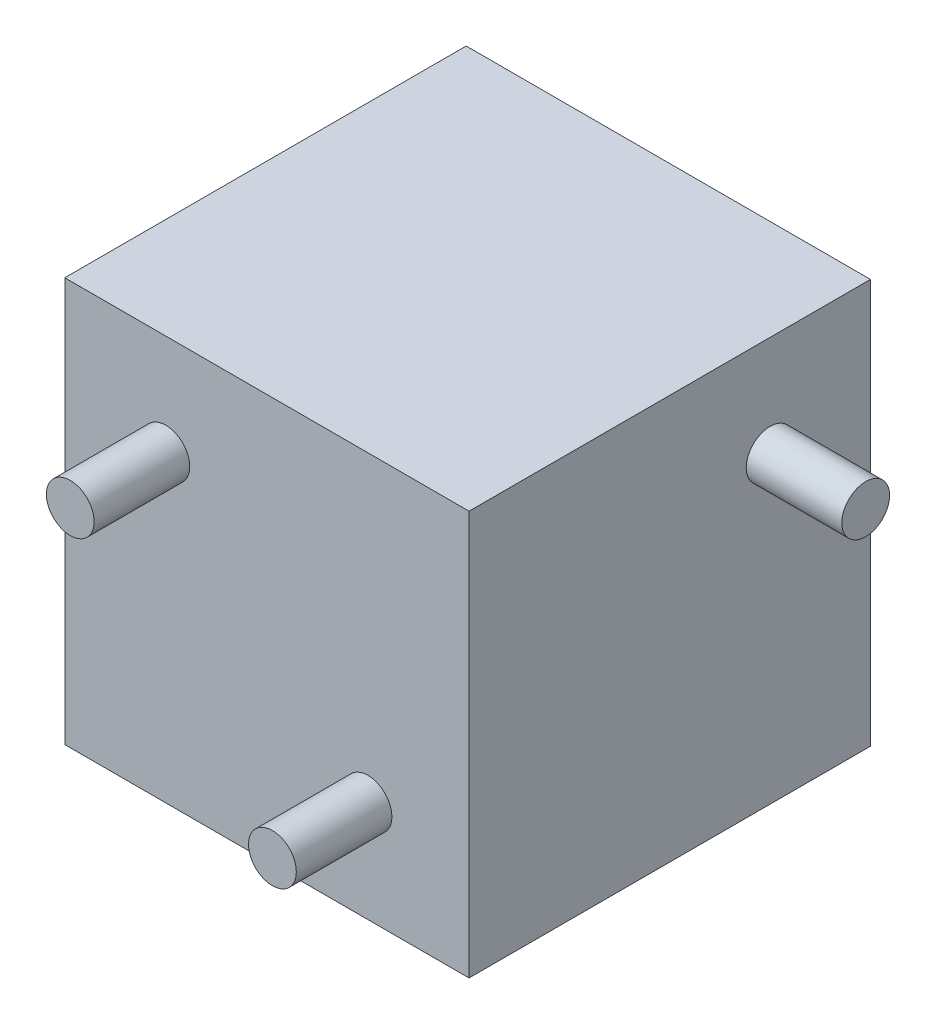
ISO-10303-21;
HEADER;
FILE_DESCRIPTION(('STEP AP214'),'2;1');
FILE_NAME('part.step','',(''),(''),'','','');
FILE_SCHEMA(('AUTOMOTIVE_DESIGN { 1 0 10303 214 1 1 1 1 }'));
ENDSEC;
DATA;
#1=APPLICATION_CONTEXT('core data for automotive mechanical design processes');
#2=APPLICATION_PROTOCOL_DEFINITION('international standard','automotive_design',2000,#1);
#3=PRODUCT_CONTEXT('',#1,'mechanical');
#4=PRODUCT('Part','Part','',(#3));
#5=PRODUCT_RELATED_PRODUCT_CATEGORY('part','',(#4));
#6=PRODUCT_DEFINITION_FORMATION('','',#4);
#7=PRODUCT_DEFINITION_CONTEXT('part definition',#1,'design');
#8=PRODUCT_DEFINITION('design','',#6,#7);
#9=PRODUCT_DEFINITION_SHAPE('','',#8);
#10=(LENGTH_UNIT() NAMED_UNIT(*) SI_UNIT(.MILLI.,.METRE.));
#11=(NAMED_UNIT(*) PLANE_ANGLE_UNIT() SI_UNIT($,.RADIAN.));
#12=(NAMED_UNIT(*) SI_UNIT($,.STERADIAN.) SOLID_ANGLE_UNIT());
#13=UNCERTAINTY_MEASURE_WITH_UNIT(LENGTH_MEASURE(1.E-05),#10,'distance_accuracy_value','');
#14=(GEOMETRIC_REPRESENTATION_CONTEXT(3) GLOBAL_UNCERTAINTY_ASSIGNED_CONTEXT((#13)) GLOBAL_UNIT_ASSIGNED_CONTEXT((#10,
#11,#12)) REPRESENTATION_CONTEXT('',''));
#15=CARTESIAN_POINT('',(0.,0.,0.));
#16=DIRECTION('',(0.,0.,1.));
#17=DIRECTION('',(1.,0.,0.));
#18=AXIS2_PLACEMENT_3D('',#15,#16,#17);
#19=CARTESIAN_POINT('',(-42.3,42.3,-10.));
#20=DIRECTION('',(0.,0.,1.));
#21=DIRECTION('',(1.,0.,0.));
#22=AXIS2_PLACEMENT_3D('',#19,#20,#21);
#23=CYLINDRICAL_SURFACE('',#22,5.);
#24=CARTESIAN_POINT('',(-42.3,42.3,-10.));
#25=DIRECTION('',(0.,0.,1.));
#26=DIRECTION('',(1.,0.,0.));
#27=AXIS2_PLACEMENT_3D('',#24,#25,#26);
#28=CIRCLE('',#27,5.);
#29=CARTESIAN_POINT('',(-37.3,42.3,-10.));
#30=VERTEX_POINT('',#29);
#31=EDGE_CURVE('E113',#30,#30,#28,.T.);
#32=ORIENTED_EDGE('',*,*,#31,.T.);
#33=EDGE_LOOP('',(#32));
#34=FACE_BOUND('',#33,.T.);
#35=CARTESIAN_POINT('',(-42.3,42.3,10.));
#36=DIRECTION('',(0.,0.,1.));
#37=DIRECTION('',(1.,0.,0.));
#38=AXIS2_PLACEMENT_3D('',#35,#36,#37);
#39=CIRCLE('',#38,5.);
#40=CARTESIAN_POINT('',(-37.3,42.3,10.));
#41=VERTEX_POINT('',#40);
#42=EDGE_CURVE('E114',#41,#41,#39,.T.);
#43=ORIENTED_EDGE('',*,*,#42,.F.);
#44=EDGE_LOOP('',(#43));
#45=FACE_BOUND('',#44,.T.);
#46=ADVANCED_FACE('F36',(#34,#45),#23,.T.);
#47=CARTESIAN_POINT('',(0.,0.,10.));
#48=DIRECTION('',(0.,0.,1.));
#49=DIRECTION('',(1.,0.,0.));
#50=AXIS2_PLACEMENT_3D('',#47,#48,#49);
#51=PLANE('',#50);
#52=ORIENTED_EDGE('',*,*,#42,.T.);
#53=EDGE_LOOP('',(#52));
#54=FACE_BOUND('',#53,.T.);
#55=ADVANCED_FACE('F145',(#54),#51,.T.);
#56=CARTESIAN_POINT('',(-63.45,-21.15,-94.));
#57=DIRECTION('',(1.,0.,0.));
#58=DIRECTION('',(0.,0.,-1.));
#59=AXIS2_PLACEMENT_3D('',#56,#57,#58);
#60=PLANE('',#59);
#61=DIRECTION('',(0.,1.,0.));
#62=VECTOR('',#61,1.);
#63=CARTESIAN_POINT('',(-63.45,-21.15,-10.));
#64=LINE('',#63,#62);
#65=CARTESIAN_POINT('',(-63.45,-21.15,-10.));
#66=VERTEX_POINT('',#65);
#67=CARTESIAN_POINT('',(-63.45,63.45,-10.));
#68=VERTEX_POINT('',#67);
#69=EDGE_CURVE('E103',#66,#68,#64,.T.);
#70=ORIENTED_EDGE('',*,*,#69,.T.);
#71=DIRECTION('',(0.,0.,1.));
#72=VECTOR('',#71,1.);
#73=CARTESIAN_POINT('',(-63.45,63.45,-94.));
#74=LINE('',#73,#72);
#75=CARTESIAN_POINT('',(-63.45,63.45,-94.));
#76=VERTEX_POINT('',#75);
#77=EDGE_CURVE('E94',#76,#68,#74,.T.);
#78=ORIENTED_EDGE('',*,*,#77,.F.);
#79=DIRECTION('',(0.,1.,0.));
#80=VECTOR('',#79,1.);
#81=CARTESIAN_POINT('',(-63.45,-21.15,-94.));
#82=LINE('',#81,#80);
#83=CARTESIAN_POINT('',(-63.45,-21.15,-94.));
#84=VERTEX_POINT('',#83);
#85=EDGE_CURVE('E88',#84,#76,#82,.T.);
#86=ORIENTED_EDGE('',*,*,#85,.F.);
#87=DIRECTION('',(0.,0.,1.));
#88=VECTOR('',#87,1.);
#89=CARTESIAN_POINT('',(-63.45,-21.15,-94.));
#90=LINE('',#89,#88);
#91=EDGE_CURVE('E99',#84,#66,#90,.T.);
#92=ORIENTED_EDGE('',*,*,#91,.T.);
#93=EDGE_LOOP('',(#70,#78,#86,#92));
#94=FACE_BOUND('',#93,.T.);
#95=ADVANCED_FACE('F132',(#94),#60,.F.);
#96=CARTESIAN_POINT('',(21.15,63.45,-94.));
#97=DIRECTION('',(0.,-1.,0.));
#98=DIRECTION('',(0.,0.,-1.));
#99=AXIS2_PLACEMENT_3D('',#96,#97,#98);
#100=PLANE('',#99);
#101=DIRECTION('',(1.,0.,0.));
#102=VECTOR('',#101,1.);
#103=CARTESIAN_POINT('',(21.15,63.45,-10.));
#104=LINE('',#103,#102);
#105=CARTESIAN_POINT('',(21.15,63.45,-10.));
#106=VERTEX_POINT('',#105);
#107=EDGE_CURVE('E93',#68,#106,#104,.T.);
#108=ORIENTED_EDGE('',*,*,#107,.T.);
#109=DIRECTION('',(0.,0.,1.));
#110=VECTOR('',#109,1.);
#111=CARTESIAN_POINT('',(21.15,63.45,-94.));
#112=LINE('',#111,#110);
#113=CARTESIAN_POINT('',(21.15,63.45,-94.));
#114=VERTEX_POINT('',#113);
#115=EDGE_CURVE('E91',#114,#106,#112,.T.);
#116=ORIENTED_EDGE('',*,*,#115,.F.);
#117=DIRECTION('',(1.,0.,0.));
#118=VECTOR('',#117,1.);
#119=CARTESIAN_POINT('',(21.15,63.45,-94.));
#120=LINE('',#119,#118);
#121=EDGE_CURVE('E83',#76,#114,#120,.T.);
#122=ORIENTED_EDGE('',*,*,#121,.F.);
#123=ORIENTED_EDGE('',*,*,#77,.T.);
#124=EDGE_LOOP('',(#108,#116,#122,#123));
#125=FACE_BOUND('',#124,.T.);
#126=ADVANCED_FACE('F92',(#125),#100,.F.);
#127=CARTESIAN_POINT('',(21.15,-21.15,-94.));
#128=DIRECTION('',(-1.,0.,0.));
#129=DIRECTION('',(0.,0.,1.));
#130=AXIS2_PLACEMENT_3D('',#127,#128,#129);
#131=PLANE('',#130);
#132=CARTESIAN_POINT('',(21.15,42.3214646234765,-73.0002290170693));
#133=DIRECTION('',(-1.,0.,0.));
#134=DIRECTION('',(0.,0.,1.));
#135=AXIS2_PLACEMENT_3D('',#132,#133,#134);
#136=CIRCLE('',#135,5.00000000000001);
#137=CARTESIAN_POINT('',(21.15,42.3214646234765,-68.0002290170693));
#138=VERTEX_POINT('',#137);
#139=EDGE_CURVE('E11',#138,#138,#136,.F.);
#140=ORIENTED_EDGE('',*,*,#139,.F.);
#141=EDGE_LOOP('',(#140));
#142=FACE_BOUND('',#141,.T.);
#143=DIRECTION('',(0.,-1.,0.));
#144=VECTOR('',#143,1.);
#145=CARTESIAN_POINT('',(21.15,-21.15,-10.));
#146=LINE('',#145,#144);
#147=CARTESIAN_POINT('',(21.15,-21.15,-10.));
#148=VERTEX_POINT('',#147);
#149=EDGE_CURVE('E69',#106,#148,#146,.T.);
#150=ORIENTED_EDGE('',*,*,#149,.T.);
#151=DIRECTION('',(0.,0.,1.));
#152=VECTOR('',#151,1.);
#153=CARTESIAN_POINT('',(21.15,-21.15,-94.));
#154=LINE('',#153,#152);
#155=CARTESIAN_POINT('',(21.15,-21.15,-94.));
#156=VERTEX_POINT('',#155);
#157=EDGE_CURVE('E95',#156,#148,#154,.T.);
#158=ORIENTED_EDGE('',*,*,#157,.F.);
#159=DIRECTION('',(0.,-1.,0.));
#160=VECTOR('',#159,1.);
#161=CARTESIAN_POINT('',(21.15,-21.15,-94.));
#162=LINE('',#161,#160);
#163=EDGE_CURVE('E86',#114,#156,#162,.T.);
#164=ORIENTED_EDGE('',*,*,#163,.F.);
#165=ORIENTED_EDGE('',*,*,#115,.T.);
#166=EDGE_LOOP('',(#150,#158,#164,#165));
#167=FACE_BOUND('',#166,.T.);
#168=ADVANCED_FACE('F97',(#142,#167),#131,.F.);
#169=CARTESIAN_POINT('',(21.15,-21.15,-94.));
#170=DIRECTION('',(0.,1.,0.));
#171=DIRECTION('',(0.,0.,1.));
#172=AXIS2_PLACEMENT_3D('',#169,#170,#171);
#173=PLANE('',#172);
#174=DIRECTION('',(-1.,0.,0.));
#175=VECTOR('',#174,1.);
#176=CARTESIAN_POINT('',(21.15,-21.15,-10.));
#177=LINE('',#176,#175);
#178=EDGE_CURVE('E75',#148,#66,#177,.T.);
#179=ORIENTED_EDGE('',*,*,#178,.T.);
#180=ORIENTED_EDGE('',*,*,#91,.F.);
#181=DIRECTION('',(-1.,0.,0.));
#182=VECTOR('',#181,1.);
#183=CARTESIAN_POINT('',(21.15,-21.15,-94.));
#184=LINE('',#183,#182);
#185=EDGE_CURVE('E52',#156,#84,#184,.T.);
#186=ORIENTED_EDGE('',*,*,#185,.F.);
#187=ORIENTED_EDGE('',*,*,#157,.T.);
#188=EDGE_LOOP('',(#179,#180,#186,#187));
#189=FACE_BOUND('',#188,.T.);
#190=ADVANCED_FACE('F133',(#189),#173,.F.);
#191=CARTESIAN_POINT('',(0.,0.,-94.));
#192=DIRECTION('',(0.,0.,1.));
#193=DIRECTION('',(1.,0.,0.));
#194=AXIS2_PLACEMENT_3D('',#191,#192,#193);
#195=PLANE('',#194);
#196=ORIENTED_EDGE('',*,*,#85,.T.);
#197=ORIENTED_EDGE('',*,*,#121,.T.);
#198=ORIENTED_EDGE('',*,*,#163,.T.);
#199=ORIENTED_EDGE('',*,*,#185,.T.);
#200=EDGE_LOOP('',(#196,#197,#198,#199));
#201=FACE_BOUND('',#200,.T.);
#202=ADVANCED_FACE('F84',(#201),#195,.F.);
#203=CARTESIAN_POINT('',(0.,0.,-10.));
#204=DIRECTION('',(0.,0.,1.));
#205=DIRECTION('',(1.,0.,0.));
#206=AXIS2_PLACEMENT_3D('',#203,#204,#205);
#207=PLANE('',#206);
#208=CARTESIAN_POINT('',(0.,0.,-10.));
#209=DIRECTION('',(0.,0.,1.));
#210=DIRECTION('',(1.,0.,0.));
#211=AXIS2_PLACEMENT_3D('',#208,#209,#210);
#212=CIRCLE('',#211,5.);
#213=CARTESIAN_POINT('',(5.,0.,-10.));
#214=VERTEX_POINT('',#213);
#215=EDGE_CURVE('E44',#214,#214,#212,.T.);
#216=ORIENTED_EDGE('',*,*,#215,.F.);
#217=EDGE_LOOP('',(#216));
#218=FACE_BOUND('',#217,.T.);
#219=ORIENTED_EDGE('',*,*,#31,.F.);
#220=EDGE_LOOP('',(#219));
#221=FACE_BOUND('',#220,.T.);
#222=ORIENTED_EDGE('',*,*,#69,.F.);
#223=ORIENTED_EDGE('',*,*,#178,.F.);
#224=ORIENTED_EDGE('',*,*,#149,.F.);
#225=ORIENTED_EDGE('',*,*,#107,.F.);
#226=EDGE_LOOP('',(#222,#223,#224,#225));
#227=FACE_BOUND('',#226,.T.);
#228=ADVANCED_FACE('F124',(#218,#221,#227),#207,.T.);
#229=CARTESIAN_POINT('',(0.,0.,-10.));
#230=DIRECTION('',(0.,0.,1.));
#231=DIRECTION('',(1.,0.,0.));
#232=AXIS2_PLACEMENT_3D('',#229,#230,#231);
#233=CYLINDRICAL_SURFACE('',#232,5.);
#234=ORIENTED_EDGE('',*,*,#215,.T.);
#235=EDGE_LOOP('',(#234));
#236=FACE_BOUND('',#235,.T.);
#237=CARTESIAN_POINT('',(0.,0.,10.));
#238=DIRECTION('',(0.,0.,1.));
#239=DIRECTION('',(1.,0.,0.));
#240=AXIS2_PLACEMENT_3D('',#237,#238,#239);
#241=CIRCLE('',#240,5.);
#242=CARTESIAN_POINT('',(5.,0.,10.));
#243=VERTEX_POINT('',#242);
#244=EDGE_CURVE('E106',#243,#243,#241,.T.);
#245=ORIENTED_EDGE('',*,*,#244,.F.);
#246=EDGE_LOOP('',(#245));
#247=FACE_BOUND('',#246,.T.);
#248=ADVANCED_FACE('F121',(#236,#247),#233,.T.);
#249=CARTESIAN_POINT('',(0.,0.,10.));
#250=DIRECTION('',(0.,0.,1.));
#251=DIRECTION('',(1.,0.,0.));
#252=AXIS2_PLACEMENT_3D('',#249,#250,#251);
#253=PLANE('',#252);
#254=ORIENTED_EDGE('',*,*,#244,.T.);
#255=EDGE_LOOP('',(#254));
#256=FACE_BOUND('',#255,.T.);
#257=ADVANCED_FACE('F191',(#256),#253,.T.);
#258=CARTESIAN_POINT('',(41.15,42.3214646234765,-73.0002290170693));
#259=DIRECTION('',(-1.,0.,0.));
#260=DIRECTION('',(0.,0.,1.));
#261=AXIS2_PLACEMENT_3D('',#258,#259,#260);
#262=CYLINDRICAL_SURFACE('',#261,5.00000000000001);
#263=CARTESIAN_POINT('',(41.15,42.3214646234765,-73.0002290170693));
#264=DIRECTION('',(1.,0.,0.));
#265=DIRECTION('',(0.,0.,-1.));
#266=AXIS2_PLACEMENT_3D('',#263,#264,#265);
#267=CIRCLE('',#266,5.00000000000001);
#268=CARTESIAN_POINT('',(41.15,42.3214646234765,-78.0002290170693));
#269=VERTEX_POINT('',#268);
#270=EDGE_CURVE('E238',#269,#269,#267,.T.);
#271=ORIENTED_EDGE('',*,*,#270,.F.);
#272=EDGE_LOOP('',(#271));
#273=FACE_BOUND('',#272,.T.);
#274=ORIENTED_EDGE('',*,*,#139,.T.);
#275=EDGE_LOOP('',(#274));
#276=FACE_BOUND('',#275,.T.);
#277=ADVANCED_FACE('F196',(#273,#276),#262,.T.);
#278=CARTESIAN_POINT('',(41.15,42.3214646234765,-73.0002290170693));
#279=DIRECTION('',(1.,0.,0.));
#280=DIRECTION('',(0.,0.,-1.));
#281=AXIS2_PLACEMENT_3D('',#278,#279,#280);
#282=PLANE('',#281);
#283=ORIENTED_EDGE('',*,*,#270,.T.);
#284=EDGE_LOOP('',(#283));
#285=FACE_BOUND('',#284,.T.);
#286=ADVANCED_FACE('F217',(#285),#282,.T.);
#287=CLOSED_SHELL('',(#46,#55,#95,#126,#168,#190,#202,#228,#248,#257,#277,#286));
#288=MANIFOLD_SOLID_BREP('B2',#287);
#289=ADVANCED_BREP_SHAPE_REPRESENTATION('',(#18,#288),#14);
#290=SHAPE_DEFINITION_REPRESENTATION(#9,#289);
ENDSEC;
END-ISO-10303-21;
